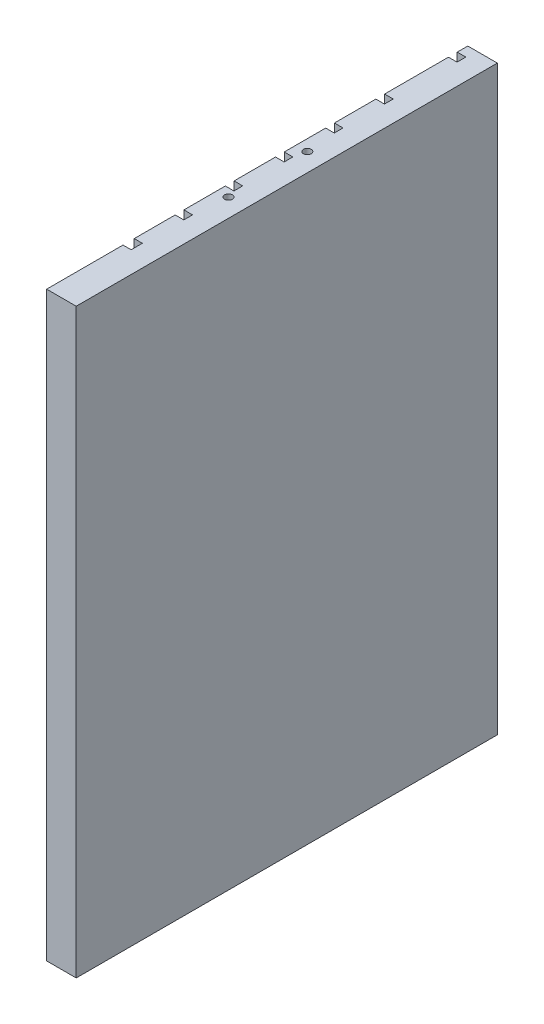
ISO-10303-21;
HEADER;
FILE_DESCRIPTION(('STEP AP214'),'2;1');
FILE_NAME('part.step','',(''),(''),'','','');
FILE_SCHEMA(('AUTOMOTIVE_DESIGN { 1 0 10303 214 1 1 1 1 }'));
ENDSEC;
DATA;
#1=APPLICATION_CONTEXT('core data for automotive mechanical design processes');
#2=APPLICATION_PROTOCOL_DEFINITION('international standard','automotive_design',2000,#1);
#3=PRODUCT_CONTEXT('',#1,'mechanical');
#4=PRODUCT('Part','Part','',(#3));
#5=PRODUCT_RELATED_PRODUCT_CATEGORY('part','',(#4));
#6=PRODUCT_DEFINITION_FORMATION('','',#4);
#7=PRODUCT_DEFINITION_CONTEXT('part definition',#1,'design');
#8=PRODUCT_DEFINITION('design','',#6,#7);
#9=PRODUCT_DEFINITION_SHAPE('','',#8);
#10=(LENGTH_UNIT() NAMED_UNIT(*) SI_UNIT(.MILLI.,.METRE.));
#11=(NAMED_UNIT(*) PLANE_ANGLE_UNIT() SI_UNIT($,.RADIAN.));
#12=(NAMED_UNIT(*) SI_UNIT($,.STERADIAN.) SOLID_ANGLE_UNIT());
#13=UNCERTAINTY_MEASURE_WITH_UNIT(LENGTH_MEASURE(1.E-05),#10,'distance_accuracy_value','');
#14=(GEOMETRIC_REPRESENTATION_CONTEXT(3) GLOBAL_UNCERTAINTY_ASSIGNED_CONTEXT((#13)) GLOBAL_UNIT_ASSIGNED_CONTEXT((#10,
#11,#12)) REPRESENTATION_CONTEXT('',''));
#15=CARTESIAN_POINT('',(0.,0.,0.));
#16=DIRECTION('',(0.,0.,1.));
#17=DIRECTION('',(1.,0.,0.));
#18=AXIS2_PLACEMENT_3D('',#15,#16,#17);
#19=CARTESIAN_POINT('',(101.4,58.5,8.56666666666665));
#20=DIRECTION('',(0.,1.,0.));
#21=DIRECTION('',(0.,0.,1.));
#22=AXIS2_PLACEMENT_3D('',#19,#20,#21);
#23=CONICAL_SURFACE('',#22,0.839500000000023,1.02974425867663);
#24=CARTESIAN_POINT('',(101.4,58.5,8.56666666666666));
#25=DIRECTION('',(0.,1.,0.));
#26=DIRECTION('',(0.,0.,1.));
#27=AXIS2_PLACEMENT_3D('',#24,#25,#26);
#28=CIRCLE('',#27,0.83950000000001);
#29=CARTESIAN_POINT('',(101.4,58.5,9.40616666666667));
#30=VERTEX_POINT('',#29);
#31=EDGE_CURVE('E487',#30,#30,#28,.T.);
#32=ORIENTED_EDGE('',*,*,#31,.T.);
#33=EDGE_LOOP('',(#32));
#34=FACE_BOUND('',#33,.T.);
#35=CARTESIAN_POINT('',(101.4,57.9955775103264,8.56666666666669));
#36=VERTEX_POINT('',#35);
#37=VERTEX_LOOP('',#36);
#38=FACE_BOUND('',#37,.T.);
#39=ADVANCED_FACE('F17',(#34,#38),#23,.F.);
#40=CARTESIAN_POINT('',(101.4,58.5,-8.36666666666667));
#41=DIRECTION('',(0.,1.,0.));
#42=DIRECTION('',(0.,0.,1.));
#43=AXIS2_PLACEMENT_3D('',#40,#41,#42);
#44=CONICAL_SURFACE('',#43,0.839500000000022,1.02974425867663);
#45=CARTESIAN_POINT('',(101.4,58.5,-8.36666666666666));
#46=DIRECTION('',(0.,1.,0.));
#47=DIRECTION('',(0.,0.,1.));
#48=AXIS2_PLACEMENT_3D('',#45,#46,#47);
#49=CIRCLE('',#48,0.83950000000001);
#50=CARTESIAN_POINT('',(101.4,58.5,-7.52716666666665));
#51=VERTEX_POINT('',#50);
#52=EDGE_CURVE('E484',#51,#51,#49,.T.);
#53=ORIENTED_EDGE('',*,*,#52,.T.);
#54=EDGE_LOOP('',(#53));
#55=FACE_BOUND('',#54,.T.);
#56=CARTESIAN_POINT('',(101.4,57.9955775103264,-8.36666666666664));
#57=VERTEX_POINT('',#56);
#58=VERTEX_LOOP('',#57);
#59=FACE_BOUND('',#58,.T.);
#60=ADVANCED_FACE('F232',(#55,#59),#44,.F.);
#61=CARTESIAN_POINT('',(101.4,62.5,8.56666666666666));
#62=DIRECTION('',(0.,-1.,0.));
#63=DIRECTION('',(0.,0.,-1.));
#64=AXIS2_PLACEMENT_3D('',#61,#62,#63);
#65=CYLINDRICAL_SURFACE('',#64,0.83950000000001);
#66=ORIENTED_EDGE('',*,*,#31,.F.);
#67=EDGE_LOOP('',(#66));
#68=FACE_BOUND('',#67,.T.);
#69=CARTESIAN_POINT('',(101.4,62.5,8.56666666666666));
#70=DIRECTION('',(0.,-1.,0.));
#71=DIRECTION('',(0.,0.,-1.));
#72=AXIS2_PLACEMENT_3D('',#69,#70,#71);
#73=CIRCLE('',#72,0.83950000000001);
#74=CARTESIAN_POINT('',(101.4,62.5,7.72716666666665));
#75=VERTEX_POINT('',#74);
#76=EDGE_CURVE('E21',#75,#75,#73,.T.);
#77=ORIENTED_EDGE('',*,*,#76,.F.);
#78=EDGE_LOOP('',(#77));
#79=FACE_BOUND('',#78,.T.);
#80=ADVANCED_FACE('F239',(#68,#79),#65,.F.);
#81=CARTESIAN_POINT('',(101.4,62.5,-8.36666666666666));
#82=DIRECTION('',(0.,-1.,0.));
#83=DIRECTION('',(0.,0.,-1.));
#84=AXIS2_PLACEMENT_3D('',#81,#82,#83);
#85=CYLINDRICAL_SURFACE('',#84,0.83950000000001);
#86=ORIENTED_EDGE('',*,*,#52,.F.);
#87=EDGE_LOOP('',(#86));
#88=FACE_BOUND('',#87,.T.);
#89=CARTESIAN_POINT('',(101.4,62.5,-8.36666666666666));
#90=DIRECTION('',(0.,-1.,0.));
#91=DIRECTION('',(0.,0.,-1.));
#92=AXIS2_PLACEMENT_3D('',#89,#90,#91);
#93=CIRCLE('',#92,0.83950000000001);
#94=CARTESIAN_POINT('',(101.4,62.5,-9.20616666666667));
#95=VERTEX_POINT('',#94);
#96=EDGE_CURVE('E329',#95,#95,#93,.T.);
#97=ORIENTED_EDGE('',*,*,#96,.F.);
#98=EDGE_LOOP('',(#97));
#99=FACE_BOUND('',#98,.T.);
#100=ADVANCED_FACE('F498',(#88,#99),#85,.F.);
#101=CARTESIAN_POINT('',(99.,62.5,-16.59));
#102=DIRECTION('',(-1.,0.,0.));
#103=DIRECTION('',(0.,0.,-1.));
#104=AXIS2_PLACEMENT_3D('',#101,#102,#103);
#105=PLANE('',#104);
#106=DIRECTION('',(0.,1.,0.));
#107=VECTOR('',#106,1.);
#108=CARTESIAN_POINT('',(99.,0.,-16.59));
#109=LINE('',#108,#107);
#110=CARTESIAN_POINT('',(99.,-62.5,-16.59));
#111=VERTEX_POINT('',#110);
#112=CARTESIAN_POINT('',(99.,62.5,-16.59));
#113=VERTEX_POINT('',#112);
#114=EDGE_CURVE('E482',#111,#113,#109,.T.);
#115=ORIENTED_EDGE('',*,*,#114,.T.);
#116=DIRECTION('',(0.,0.,1.));
#117=VECTOR('',#116,1.);
#118=CARTESIAN_POINT('',(99.,62.5,0.));
#119=LINE('',#118,#117);
#120=CARTESIAN_POINT('',(99.,62.5,-25.49));
#121=VERTEX_POINT('',#120);
#122=EDGE_CURVE('E414',#121,#113,#119,.T.);
#123=ORIENTED_EDGE('',*,*,#122,.F.);
#124=DIRECTION('',(0.,-1.,0.));
#125=VECTOR('',#124,1.);
#126=CARTESIAN_POINT('',(99.,0.,-25.49));
#127=LINE('',#126,#125);
#128=CARTESIAN_POINT('',(99.,-62.5,-25.49));
#129=VERTEX_POINT('',#128);
#130=EDGE_CURVE('E424',#121,#129,#127,.T.);
#131=ORIENTED_EDGE('',*,*,#130,.T.);
#132=DIRECTION('',(0.,0.,1.));
#133=VECTOR('',#132,1.);
#134=CARTESIAN_POINT('',(99.,-62.5,0.));
#135=LINE('',#134,#133);
#136=EDGE_CURVE('E323',#129,#111,#135,.T.);
#137=ORIENTED_EDGE('',*,*,#136,.T.);
#138=EDGE_LOOP('',(#115,#123,#131,#137));
#139=FACE_BOUND('',#138,.T.);
#140=ADVANCED_FACE('F504',(#139),#105,.T.);
#141=CARTESIAN_POINT('',(99.,62.5,-16.59));
#142=DIRECTION('',(0.,0.,-1.));
#143=DIRECTION('',(1.,0.,0.));
#144=AXIS2_PLACEMENT_3D('',#141,#142,#143);
#145=PLANE('',#144);
#146=ORIENTED_EDGE('',*,*,#114,.F.);
#147=DIRECTION('',(1.,0.,0.));
#148=VECTOR('',#147,1.);
#149=CARTESIAN_POINT('',(102.175000000001,-62.5,-16.59));
#150=LINE('',#149,#148);
#151=CARTESIAN_POINT('',(100.85,-62.5,-16.59));
#152=VERTEX_POINT('',#151);
#153=EDGE_CURVE('E321',#111,#152,#150,.T.);
#154=ORIENTED_EDGE('',*,*,#153,.T.);
#155=DIRECTION('',(0.,1.,0.));
#156=VECTOR('',#155,1.);
#157=CARTESIAN_POINT('',(100.85,0.,-16.59));
#158=LINE('',#157,#156);
#159=CARTESIAN_POINT('',(100.85,62.5,-16.59));
#160=VERTEX_POINT('',#159);
#161=EDGE_CURVE('E480',#152,#160,#158,.T.);
#162=ORIENTED_EDGE('',*,*,#161,.T.);
#163=DIRECTION('',(1.,0.,0.));
#164=VECTOR('',#163,1.);
#165=CARTESIAN_POINT('',(102.175,62.5,-16.59));
#166=LINE('',#165,#164);
#167=EDGE_CURVE('E411',#113,#160,#166,.T.);
#168=ORIENTED_EDGE('',*,*,#167,.F.);
#169=EDGE_LOOP('',(#146,#154,#162,#168));
#170=FACE_BOUND('',#169,.T.);
#171=ADVANCED_FACE('F511',(#170),#145,.F.);
#172=CARTESIAN_POINT('',(100.85,62.5,-16.59));
#173=DIRECTION('',(1.,0.,0.));
#174=DIRECTION('',(0.,0.,1.));
#175=AXIS2_PLACEMENT_3D('',#172,#173,#174);
#176=PLANE('',#175);
#177=ORIENTED_EDGE('',*,*,#161,.F.);
#178=DIRECTION('',(0.,0.,1.));
#179=VECTOR('',#178,1.);
#180=CARTESIAN_POINT('',(100.85,-62.5,0.));
#181=LINE('',#180,#179);
#182=CARTESIAN_POINT('',(100.85,-62.5,-14.71));
#183=VERTEX_POINT('',#182);
#184=EDGE_CURVE('E319',#152,#183,#181,.T.);
#185=ORIENTED_EDGE('',*,*,#184,.T.);
#186=DIRECTION('',(0.,1.,0.));
#187=VECTOR('',#186,1.);
#188=CARTESIAN_POINT('',(100.85,0.,-14.71));
#189=LINE('',#188,#187);
#190=CARTESIAN_POINT('',(100.85,62.5,-14.71));
#191=VERTEX_POINT('',#190);
#192=EDGE_CURVE('E478',#183,#191,#189,.T.);
#193=ORIENTED_EDGE('',*,*,#192,.T.);
#194=DIRECTION('',(0.,0.,1.));
#195=VECTOR('',#194,1.);
#196=CARTESIAN_POINT('',(100.85,62.5,0.));
#197=LINE('',#196,#195);
#198=EDGE_CURVE('E408',#160,#191,#197,.T.);
#199=ORIENTED_EDGE('',*,*,#198,.F.);
#200=EDGE_LOOP('',(#177,#185,#193,#199));
#201=FACE_BOUND('',#200,.T.);
#202=ADVANCED_FACE('F515',(#201),#176,.F.);
#203=CARTESIAN_POINT('',(100.85,62.5,-14.71));
#204=DIRECTION('',(0.,0.,1.));
#205=DIRECTION('',(-1.,0.,0.));
#206=AXIS2_PLACEMENT_3D('',#203,#204,#205);
#207=PLANE('',#206);
#208=ORIENTED_EDGE('',*,*,#192,.F.);
#209=DIRECTION('',(-1.,0.,0.));
#210=VECTOR('',#209,1.);
#211=CARTESIAN_POINT('',(102.175000000001,-62.5,-14.71));
#212=LINE('',#211,#210);
#213=CARTESIAN_POINT('',(99.,-62.5,-14.71));
#214=VERTEX_POINT('',#213);
#215=EDGE_CURVE('E317',#183,#214,#212,.T.);
#216=ORIENTED_EDGE('',*,*,#215,.T.);
#217=DIRECTION('',(0.,-1.,0.));
#218=VECTOR('',#217,1.);
#219=CARTESIAN_POINT('',(99.0000000000001,0.,-14.71));
#220=LINE('',#219,#218);
#221=CARTESIAN_POINT('',(99.,62.5,-14.71));
#222=VERTEX_POINT('',#221);
#223=EDGE_CURVE('E475',#222,#214,#220,.T.);
#224=ORIENTED_EDGE('',*,*,#223,.F.);
#225=DIRECTION('',(-1.,0.,0.));
#226=VECTOR('',#225,1.);
#227=CARTESIAN_POINT('',(102.175,62.5,-14.71));
#228=LINE('',#227,#226);
#229=EDGE_CURVE('E405',#191,#222,#228,.T.);
#230=ORIENTED_EDGE('',*,*,#229,.F.);
#231=EDGE_LOOP('',(#208,#216,#224,#230));
#232=FACE_BOUND('',#231,.T.);
#233=ADVANCED_FACE('F519',(#232),#207,.F.);
#234=CARTESIAN_POINT('',(99.,62.5,-5.81));
#235=DIRECTION('',(-1.,0.,0.));
#236=DIRECTION('',(0.,0.,-1.));
#237=AXIS2_PLACEMENT_3D('',#234,#235,#236);
#238=PLANE('',#237);
#239=ORIENTED_EDGE('',*,*,#223,.T.);
#240=DIRECTION('',(0.,0.,1.));
#241=VECTOR('',#240,1.);
#242=CARTESIAN_POINT('',(99.,-62.5,0.));
#243=LINE('',#242,#241);
#244=CARTESIAN_POINT('',(99.,-62.5,-5.81));
#245=VERTEX_POINT('',#244);
#246=EDGE_CURVE('E315',#214,#245,#243,.T.);
#247=ORIENTED_EDGE('',*,*,#246,.T.);
#248=DIRECTION('',(0.,1.,0.));
#249=VECTOR('',#248,1.);
#250=CARTESIAN_POINT('',(99.,0.,-5.81000000000001));
#251=LINE('',#250,#249);
#252=CARTESIAN_POINT('',(99.,62.5,-5.81000000000001));
#253=VERTEX_POINT('',#252);
#254=EDGE_CURVE('E473',#245,#253,#251,.T.);
#255=ORIENTED_EDGE('',*,*,#254,.T.);
#256=DIRECTION('',(0.,0.,1.));
#257=VECTOR('',#256,1.);
#258=CARTESIAN_POINT('',(99.,62.5,0.));
#259=LINE('',#258,#257);
#260=EDGE_CURVE('E402',#222,#253,#259,.T.);
#261=ORIENTED_EDGE('',*,*,#260,.F.);
#262=EDGE_LOOP('',(#239,#247,#255,#261));
#263=FACE_BOUND('',#262,.T.);
#264=ADVANCED_FACE('F523',(#263),#238,.T.);
#265=CARTESIAN_POINT('',(99.,62.5,-5.81000000000001));
#266=DIRECTION('',(0.,0.,-1.));
#267=DIRECTION('',(1.,0.,0.));
#268=AXIS2_PLACEMENT_3D('',#265,#266,#267);
#269=PLANE('',#268);
#270=ORIENTED_EDGE('',*,*,#254,.F.);
#271=DIRECTION('',(1.,0.,0.));
#272=VECTOR('',#271,1.);
#273=CARTESIAN_POINT('',(102.175000000001,-62.5,-5.81000000000001));
#274=LINE('',#273,#272);
#275=CARTESIAN_POINT('',(100.85,-62.5,-5.81000000000001));
#276=VERTEX_POINT('',#275);
#277=EDGE_CURVE('E313',#245,#276,#274,.T.);
#278=ORIENTED_EDGE('',*,*,#277,.T.);
#279=DIRECTION('',(0.,1.,0.));
#280=VECTOR('',#279,1.);
#281=CARTESIAN_POINT('',(100.85,0.,-5.81000000000001));
#282=LINE('',#281,#280);
#283=CARTESIAN_POINT('',(100.85,62.5,-5.81000000000001));
#284=VERTEX_POINT('',#283);
#285=EDGE_CURVE('E471',#276,#284,#282,.T.);
#286=ORIENTED_EDGE('',*,*,#285,.T.);
#287=DIRECTION('',(1.,0.,0.));
#288=VECTOR('',#287,1.);
#289=CARTESIAN_POINT('',(102.175,62.5,-5.81000000000001));
#290=LINE('',#289,#288);
#291=EDGE_CURVE('E399',#253,#284,#290,.T.);
#292=ORIENTED_EDGE('',*,*,#291,.F.);
#293=EDGE_LOOP('',(#270,#278,#286,#292));
#294=FACE_BOUND('',#293,.T.);
#295=ADVANCED_FACE('F527',(#294),#269,.F.);
#296=CARTESIAN_POINT('',(100.85,62.5,-5.81000000000001));
#297=DIRECTION('',(1.,0.,0.));
#298=DIRECTION('',(0.,0.,1.));
#299=AXIS2_PLACEMENT_3D('',#296,#297,#298);
#300=PLANE('',#299);
#301=ORIENTED_EDGE('',*,*,#285,.F.);
#302=DIRECTION('',(0.,0.,1.));
#303=VECTOR('',#302,1.);
#304=CARTESIAN_POINT('',(100.85,-62.5,0.));
#305=LINE('',#304,#303);
#306=CARTESIAN_POINT('',(100.85,-62.5,-3.93000000000001));
#307=VERTEX_POINT('',#306);
#308=EDGE_CURVE('E311',#276,#307,#305,.T.);
#309=ORIENTED_EDGE('',*,*,#308,.T.);
#310=DIRECTION('',(0.,1.,0.));
#311=VECTOR('',#310,1.);
#312=CARTESIAN_POINT('',(100.85,0.,-3.93000000000001));
#313=LINE('',#312,#311);
#314=CARTESIAN_POINT('',(100.85,62.5,-3.93000000000001));
#315=VERTEX_POINT('',#314);
#316=EDGE_CURVE('E469',#307,#315,#313,.T.);
#317=ORIENTED_EDGE('',*,*,#316,.T.);
#318=DIRECTION('',(0.,0.,1.));
#319=VECTOR('',#318,1.);
#320=CARTESIAN_POINT('',(100.85,62.5,0.));
#321=LINE('',#320,#319);
#322=EDGE_CURVE('E396',#284,#315,#321,.T.);
#323=ORIENTED_EDGE('',*,*,#322,.F.);
#324=EDGE_LOOP('',(#301,#309,#317,#323));
#325=FACE_BOUND('',#324,.T.);
#326=ADVANCED_FACE('F531',(#325),#300,.F.);
#327=CARTESIAN_POINT('',(100.85,62.5,-3.93000000000002));
#328=DIRECTION('',(0.,0.,1.));
#329=DIRECTION('',(-1.,0.,0.));
#330=AXIS2_PLACEMENT_3D('',#327,#328,#329);
#331=PLANE('',#330);
#332=ORIENTED_EDGE('',*,*,#316,.F.);
#333=DIRECTION('',(-1.,0.,0.));
#334=VECTOR('',#333,1.);
#335=CARTESIAN_POINT('',(102.175000000001,-62.5,-3.93000000000001));
#336=LINE('',#335,#334);
#337=CARTESIAN_POINT('',(99.,-62.5,-3.93000000000001));
#338=VERTEX_POINT('',#337);
#339=EDGE_CURVE('E309',#307,#338,#336,.T.);
#340=ORIENTED_EDGE('',*,*,#339,.T.);
#341=DIRECTION('',(0.,-1.,0.));
#342=VECTOR('',#341,1.);
#343=CARTESIAN_POINT('',(99.0000000000001,0.,-3.93000000000001));
#344=LINE('',#343,#342);
#345=CARTESIAN_POINT('',(99.,62.5,-3.93000000000002));
#346=VERTEX_POINT('',#345);
#347=EDGE_CURVE('E466',#346,#338,#344,.T.);
#348=ORIENTED_EDGE('',*,*,#347,.F.);
#349=DIRECTION('',(-1.,0.,0.));
#350=VECTOR('',#349,1.);
#351=CARTESIAN_POINT('',(102.175,62.5,-3.93000000000002));
#352=LINE('',#351,#350);
#353=EDGE_CURVE('E393',#315,#346,#352,.T.);
#354=ORIENTED_EDGE('',*,*,#353,.F.);
#355=EDGE_LOOP('',(#332,#340,#348,#354));
#356=FACE_BOUND('',#355,.T.);
#357=ADVANCED_FACE('F535',(#356),#331,.F.);
#358=CARTESIAN_POINT('',(99.,62.5,4.97));
#359=DIRECTION('',(-1.,0.,0.));
#360=DIRECTION('',(0.,0.,-1.));
#361=AXIS2_PLACEMENT_3D('',#358,#359,#360);
#362=PLANE('',#361);
#363=DIRECTION('',(0.,1.,0.));
#364=VECTOR('',#363,1.);
#365=CARTESIAN_POINT('',(99.,0.,4.97));
#366=LINE('',#365,#364);
#367=CARTESIAN_POINT('',(99.,-62.5,4.97));
#368=VERTEX_POINT('',#367);
#369=CARTESIAN_POINT('',(99.,62.5,4.97));
#370=VERTEX_POINT('',#369);
#371=EDGE_CURVE('E464',#368,#370,#366,.T.);
#372=ORIENTED_EDGE('',*,*,#371,.T.);
#373=DIRECTION('',(0.,0.,1.));
#374=VECTOR('',#373,1.);
#375=CARTESIAN_POINT('',(99.,62.5,0.));
#376=LINE('',#375,#374);
#377=EDGE_CURVE('E390',#346,#370,#376,.T.);
#378=ORIENTED_EDGE('',*,*,#377,.F.);
#379=ORIENTED_EDGE('',*,*,#347,.T.);
#380=DIRECTION('',(0.,0.,1.));
#381=VECTOR('',#380,1.);
#382=CARTESIAN_POINT('',(99.,-62.5,0.));
#383=LINE('',#382,#381);
#384=EDGE_CURVE('E307',#338,#368,#383,.T.);
#385=ORIENTED_EDGE('',*,*,#384,.T.);
#386=EDGE_LOOP('',(#372,#378,#379,#385));
#387=FACE_BOUND('',#386,.T.);
#388=ADVANCED_FACE('F539',(#387),#362,.T.);
#389=CARTESIAN_POINT('',(99.,62.5,4.96999999999999));
#390=DIRECTION('',(0.,0.,-1.));
#391=DIRECTION('',(1.,0.,0.));
#392=AXIS2_PLACEMENT_3D('',#389,#390,#391);
#393=PLANE('',#392);
#394=ORIENTED_EDGE('',*,*,#371,.F.);
#395=DIRECTION('',(1.,0.,0.));
#396=VECTOR('',#395,1.);
#397=CARTESIAN_POINT('',(102.175000000001,-62.5,4.97));
#398=LINE('',#397,#396);
#399=CARTESIAN_POINT('',(100.85,-62.5,4.97));
#400=VERTEX_POINT('',#399);
#401=EDGE_CURVE('E305',#368,#400,#398,.T.);
#402=ORIENTED_EDGE('',*,*,#401,.T.);
#403=DIRECTION('',(0.,1.,0.));
#404=VECTOR('',#403,1.);
#405=CARTESIAN_POINT('',(100.85,0.,4.96999999999999));
#406=LINE('',#405,#404);
#407=CARTESIAN_POINT('',(100.85,62.5,4.96999999999999));
#408=VERTEX_POINT('',#407);
#409=EDGE_CURVE('E462',#400,#408,#406,.T.);
#410=ORIENTED_EDGE('',*,*,#409,.T.);
#411=DIRECTION('',(1.,0.,0.));
#412=VECTOR('',#411,1.);
#413=CARTESIAN_POINT('',(102.175,62.5,4.97));
#414=LINE('',#413,#412);
#415=EDGE_CURVE('E387',#370,#408,#414,.T.);
#416=ORIENTED_EDGE('',*,*,#415,.F.);
#417=EDGE_LOOP('',(#394,#402,#410,#416));
#418=FACE_BOUND('',#417,.T.);
#419=ADVANCED_FACE('F543',(#418),#393,.F.);
#420=CARTESIAN_POINT('',(100.85,62.5,4.96999999999999));
#421=DIRECTION('',(1.,0.,0.));
#422=DIRECTION('',(0.,0.,1.));
#423=AXIS2_PLACEMENT_3D('',#420,#421,#422);
#424=PLANE('',#423);
#425=ORIENTED_EDGE('',*,*,#409,.F.);
#426=DIRECTION('',(0.,0.,1.));
#427=VECTOR('',#426,1.);
#428=CARTESIAN_POINT('',(100.85,-62.5,0.));
#429=LINE('',#428,#427);
#430=CARTESIAN_POINT('',(100.85,-62.5,6.85));
#431=VERTEX_POINT('',#430);
#432=EDGE_CURVE('E303',#400,#431,#429,.T.);
#433=ORIENTED_EDGE('',*,*,#432,.T.);
#434=DIRECTION('',(0.,1.,0.));
#435=VECTOR('',#434,1.);
#436=CARTESIAN_POINT('',(100.85,0.,6.84999999999999));
#437=LINE('',#436,#435);
#438=CARTESIAN_POINT('',(100.85,62.5,6.84999999999999));
#439=VERTEX_POINT('',#438);
#440=EDGE_CURVE('E460',#431,#439,#437,.T.);
#441=ORIENTED_EDGE('',*,*,#440,.T.);
#442=DIRECTION('',(0.,0.,1.));
#443=VECTOR('',#442,1.);
#444=CARTESIAN_POINT('',(100.85,62.5,0.));
#445=LINE('',#444,#443);
#446=EDGE_CURVE('E384',#408,#439,#445,.T.);
#447=ORIENTED_EDGE('',*,*,#446,.F.);
#448=EDGE_LOOP('',(#425,#433,#441,#447));
#449=FACE_BOUND('',#448,.T.);
#450=ADVANCED_FACE('F547',(#449),#424,.F.);
#451=CARTESIAN_POINT('',(100.85,62.5,6.84999999999999));
#452=DIRECTION('',(0.,0.,1.));
#453=DIRECTION('',(-1.,0.,0.));
#454=AXIS2_PLACEMENT_3D('',#451,#452,#453);
#455=PLANE('',#454);
#456=ORIENTED_EDGE('',*,*,#440,.F.);
#457=DIRECTION('',(-1.,0.,0.));
#458=VECTOR('',#457,1.);
#459=CARTESIAN_POINT('',(102.175000000001,-62.5,6.85));
#460=LINE('',#459,#458);
#461=CARTESIAN_POINT('',(99.,-62.5,6.84999999999999));
#462=VERTEX_POINT('',#461);
#463=EDGE_CURVE('E301',#431,#462,#460,.T.);
#464=ORIENTED_EDGE('',*,*,#463,.T.);
#465=DIRECTION('',(0.,-1.,0.));
#466=VECTOR('',#465,1.);
#467=CARTESIAN_POINT('',(99.0000000000001,0.,6.84999999999999));
#468=LINE('',#467,#466);
#469=CARTESIAN_POINT('',(99.,62.5,6.84999999999999));
#470=VERTEX_POINT('',#469);
#471=EDGE_CURVE('E457',#470,#462,#468,.T.);
#472=ORIENTED_EDGE('',*,*,#471,.F.);
#473=DIRECTION('',(-1.,0.,0.));
#474=VECTOR('',#473,1.);
#475=CARTESIAN_POINT('',(102.175,62.5,6.84999999999999));
#476=LINE('',#475,#474);
#477=EDGE_CURVE('E381',#439,#470,#476,.T.);
#478=ORIENTED_EDGE('',*,*,#477,.F.);
#479=EDGE_LOOP('',(#456,#464,#472,#478));
#480=FACE_BOUND('',#479,.T.);
#481=ADVANCED_FACE('F551',(#480),#455,.F.);
#482=CARTESIAN_POINT('',(99.,62.5,15.75));
#483=DIRECTION('',(-1.,0.,0.));
#484=DIRECTION('',(0.,0.,-1.));
#485=AXIS2_PLACEMENT_3D('',#482,#483,#484);
#486=PLANE('',#485);
#487=ORIENTED_EDGE('',*,*,#471,.T.);
#488=DIRECTION('',(0.,0.,1.));
#489=VECTOR('',#488,1.);
#490=CARTESIAN_POINT('',(99.,-62.5,0.));
#491=LINE('',#490,#489);
#492=CARTESIAN_POINT('',(99.,-62.5,15.75));
#493=VERTEX_POINT('',#492);
#494=EDGE_CURVE('E299',#462,#493,#491,.T.);
#495=ORIENTED_EDGE('',*,*,#494,.T.);
#496=DIRECTION('',(0.,1.,0.));
#497=VECTOR('',#496,1.);
#498=CARTESIAN_POINT('',(99.,0.,15.75));
#499=LINE('',#498,#497);
#500=CARTESIAN_POINT('',(99.,62.5,15.75));
#501=VERTEX_POINT('',#500);
#502=EDGE_CURVE('E455',#493,#501,#499,.T.);
#503=ORIENTED_EDGE('',*,*,#502,.T.);
#504=DIRECTION('',(0.,0.,1.));
#505=VECTOR('',#504,1.);
#506=CARTESIAN_POINT('',(99.,62.5,0.));
#507=LINE('',#506,#505);
#508=EDGE_CURVE('E378',#470,#501,#507,.T.);
#509=ORIENTED_EDGE('',*,*,#508,.F.);
#510=EDGE_LOOP('',(#487,#495,#503,#509));
#511=FACE_BOUND('',#510,.T.);
#512=ADVANCED_FACE('F555',(#511),#486,.T.);
#513=CARTESIAN_POINT('',(99.,62.5,15.75));
#514=DIRECTION('',(0.,0.,-1.));
#515=DIRECTION('',(1.,0.,0.));
#516=AXIS2_PLACEMENT_3D('',#513,#514,#515);
#517=PLANE('',#516);
#518=ORIENTED_EDGE('',*,*,#502,.F.);
#519=DIRECTION('',(1.,0.,0.));
#520=VECTOR('',#519,1.);
#521=CARTESIAN_POINT('',(102.175000000001,-62.5,15.75));
#522=LINE('',#521,#520);
#523=CARTESIAN_POINT('',(100.85,-62.5,15.75));
#524=VERTEX_POINT('',#523);
#525=EDGE_CURVE('E297',#493,#524,#522,.T.);
#526=ORIENTED_EDGE('',*,*,#525,.T.);
#527=DIRECTION('',(0.,1.,0.));
#528=VECTOR('',#527,1.);
#529=CARTESIAN_POINT('',(100.85,0.,15.75));
#530=LINE('',#529,#528);
#531=CARTESIAN_POINT('',(100.85,62.5,15.75));
#532=VERTEX_POINT('',#531);
#533=EDGE_CURVE('E453',#524,#532,#530,.T.);
#534=ORIENTED_EDGE('',*,*,#533,.T.);
#535=DIRECTION('',(1.,0.,0.));
#536=VECTOR('',#535,1.);
#537=CARTESIAN_POINT('',(102.175,62.5,15.75));
#538=LINE('',#537,#536);
#539=EDGE_CURVE('E375',#501,#532,#538,.T.);
#540=ORIENTED_EDGE('',*,*,#539,.F.);
#541=EDGE_LOOP('',(#518,#526,#534,#540));
#542=FACE_BOUND('',#541,.T.);
#543=ADVANCED_FACE('F559',(#542),#517,.F.);
#544=CARTESIAN_POINT('',(100.85,62.5,15.75));
#545=DIRECTION('',(1.,0.,0.));
#546=DIRECTION('',(0.,0.,1.));
#547=AXIS2_PLACEMENT_3D('',#544,#545,#546);
#548=PLANE('',#547);
#549=ORIENTED_EDGE('',*,*,#533,.F.);
#550=DIRECTION('',(0.,0.,1.));
#551=VECTOR('',#550,1.);
#552=CARTESIAN_POINT('',(100.85,-62.5,0.));
#553=LINE('',#552,#551);
#554=CARTESIAN_POINT('',(100.85,-62.5,17.63));
#555=VERTEX_POINT('',#554);
#556=EDGE_CURVE('E295',#524,#555,#553,.T.);
#557=ORIENTED_EDGE('',*,*,#556,.T.);
#558=DIRECTION('',(0.,1.,0.));
#559=VECTOR('',#558,1.);
#560=CARTESIAN_POINT('',(100.85,0.,17.63));
#561=LINE('',#560,#559);
#562=CARTESIAN_POINT('',(100.85,62.5,17.63));
#563=VERTEX_POINT('',#562);
#564=EDGE_CURVE('E451',#555,#563,#561,.T.);
#565=ORIENTED_EDGE('',*,*,#564,.T.);
#566=DIRECTION('',(0.,0.,1.));
#567=VECTOR('',#566,1.);
#568=CARTESIAN_POINT('',(100.85,62.5,0.));
#569=LINE('',#568,#567);
#570=EDGE_CURVE('E372',#532,#563,#569,.T.);
#571=ORIENTED_EDGE('',*,*,#570,.F.);
#572=EDGE_LOOP('',(#549,#557,#565,#571));
#573=FACE_BOUND('',#572,.T.);
#574=ADVANCED_FACE('F563',(#573),#548,.F.);
#575=CARTESIAN_POINT('',(100.85,62.5,17.63));
#576=DIRECTION('',(0.,0.,1.));
#577=DIRECTION('',(-1.,0.,0.));
#578=AXIS2_PLACEMENT_3D('',#575,#576,#577);
#579=PLANE('',#578);
#580=ORIENTED_EDGE('',*,*,#564,.F.);
#581=DIRECTION('',(-1.,0.,0.));
#582=VECTOR('',#581,1.);
#583=CARTESIAN_POINT('',(102.175000000001,-62.5,17.63));
#584=LINE('',#583,#582);
#585=CARTESIAN_POINT('',(99.,-62.5,17.63));
#586=VERTEX_POINT('',#585);
#587=EDGE_CURVE('E293',#555,#586,#584,.T.);
#588=ORIENTED_EDGE('',*,*,#587,.T.);
#589=DIRECTION('',(0.,-1.,0.));
#590=VECTOR('',#589,1.);
#591=CARTESIAN_POINT('',(99.0000000000001,0.,17.63));
#592=LINE('',#591,#590);
#593=CARTESIAN_POINT('',(99.,62.5,17.63));
#594=VERTEX_POINT('',#593);
#595=EDGE_CURVE('E448',#594,#586,#592,.T.);
#596=ORIENTED_EDGE('',*,*,#595,.F.);
#597=DIRECTION('',(-1.,0.,0.));
#598=VECTOR('',#597,1.);
#599=CARTESIAN_POINT('',(102.175,62.5,17.63));
#600=LINE('',#599,#598);
#601=EDGE_CURVE('E369',#563,#594,#600,.T.);
#602=ORIENTED_EDGE('',*,*,#601,.F.);
#603=EDGE_LOOP('',(#580,#588,#596,#602));
#604=FACE_BOUND('',#603,.T.);
#605=ADVANCED_FACE('F567',(#604),#579,.F.);
#606=CARTESIAN_POINT('',(99.,62.5,26.423));
#607=DIRECTION('',(-1.,0.,0.));
#608=DIRECTION('',(0.,0.,-1.));
#609=AXIS2_PLACEMENT_3D('',#606,#607,#608);
#610=PLANE('',#609);
#611=DIRECTION('',(0.,1.,0.));
#612=VECTOR('',#611,1.);
#613=CARTESIAN_POINT('',(99.,0.,26.423));
#614=LINE('',#613,#612);
#615=CARTESIAN_POINT('',(99.,-62.5,26.423));
#616=VERTEX_POINT('',#615);
#617=CARTESIAN_POINT('',(99.,62.5,26.423));
#618=VERTEX_POINT('',#617);
#619=EDGE_CURVE('E446',#616,#618,#614,.T.);
#620=ORIENTED_EDGE('',*,*,#619,.T.);
#621=DIRECTION('',(0.,0.,1.));
#622=VECTOR('',#621,1.);
#623=CARTESIAN_POINT('',(99.,62.5,0.));
#624=LINE('',#623,#622);
#625=EDGE_CURVE('E366',#594,#618,#624,.T.);
#626=ORIENTED_EDGE('',*,*,#625,.F.);
#627=ORIENTED_EDGE('',*,*,#595,.T.);
#628=DIRECTION('',(0.,0.,1.));
#629=VECTOR('',#628,1.);
#630=CARTESIAN_POINT('',(99.,-62.5,0.));
#631=LINE('',#630,#629);
#632=EDGE_CURVE('E291',#586,#616,#631,.T.);
#633=ORIENTED_EDGE('',*,*,#632,.T.);
#634=EDGE_LOOP('',(#620,#626,#627,#633));
#635=FACE_BOUND('',#634,.T.);
#636=ADVANCED_FACE('F571',(#635),#610,.T.);
#637=CARTESIAN_POINT('',(99.,62.5,26.423));
#638=DIRECTION('',(0.,0.,-1.));
#639=DIRECTION('',(1.,0.,0.));
#640=AXIS2_PLACEMENT_3D('',#637,#638,#639);
#641=PLANE('',#640);
#642=ORIENTED_EDGE('',*,*,#619,.F.);
#643=DIRECTION('',(1.,0.,0.));
#644=VECTOR('',#643,1.);
#645=CARTESIAN_POINT('',(102.175000000001,-62.5,26.423));
#646=LINE('',#645,#644);
#647=CARTESIAN_POINT('',(100.75,-62.5,26.423));
#648=VERTEX_POINT('',#647);
#649=EDGE_CURVE('E289',#616,#648,#646,.T.);
#650=ORIENTED_EDGE('',*,*,#649,.T.);
#651=DIRECTION('',(0.,1.,0.));
#652=VECTOR('',#651,1.);
#653=CARTESIAN_POINT('',(100.75,0.,26.423));
#654=LINE('',#653,#652);
#655=CARTESIAN_POINT('',(100.75,62.5,26.423));
#656=VERTEX_POINT('',#655);
#657=EDGE_CURVE('E444',#648,#656,#654,.T.);
#658=ORIENTED_EDGE('',*,*,#657,.T.);
#659=DIRECTION('',(1.,0.,0.));
#660=VECTOR('',#659,1.);
#661=CARTESIAN_POINT('',(102.175,62.5,26.423));
#662=LINE('',#661,#660);
#663=EDGE_CURVE('E363',#618,#656,#662,.T.);
#664=ORIENTED_EDGE('',*,*,#663,.F.);
#665=EDGE_LOOP('',(#642,#650,#658,#664));
#666=FACE_BOUND('',#665,.T.);
#667=ADVANCED_FACE('F575',(#666),#641,.F.);
#668=CARTESIAN_POINT('',(100.75,62.5,26.423));
#669=DIRECTION('',(1.,0.,0.));
#670=DIRECTION('',(0.,0.,1.));
#671=AXIS2_PLACEMENT_3D('',#668,#669,#670);
#672=PLANE('',#671);
#673=ORIENTED_EDGE('',*,*,#657,.F.);
#674=DIRECTION('',(0.,0.,1.));
#675=VECTOR('',#674,1.);
#676=CARTESIAN_POINT('',(100.75,-62.5,0.));
#677=LINE('',#676,#675);
#678=CARTESIAN_POINT('',(100.75,-62.5,28.837));
#679=VERTEX_POINT('',#678);
#680=EDGE_CURVE('E287',#648,#679,#677,.T.);
#681=ORIENTED_EDGE('',*,*,#680,.T.);
#682=DIRECTION('',(0.,1.,0.));
#683=VECTOR('',#682,1.);
#684=CARTESIAN_POINT('',(100.75,0.,28.837));
#685=LINE('',#684,#683);
#686=CARTESIAN_POINT('',(100.75,62.5,28.837));
#687=VERTEX_POINT('',#686);
#688=EDGE_CURVE('E442',#679,#687,#685,.T.);
#689=ORIENTED_EDGE('',*,*,#688,.T.);
#690=DIRECTION('',(0.,0.,1.));
#691=VECTOR('',#690,1.);
#692=CARTESIAN_POINT('',(100.75,62.5,0.));
#693=LINE('',#692,#691);
#694=EDGE_CURVE('E360',#656,#687,#693,.T.);
#695=ORIENTED_EDGE('',*,*,#694,.F.);
#696=EDGE_LOOP('',(#673,#681,#689,#695));
#697=FACE_BOUND('',#696,.T.);
#698=ADVANCED_FACE('F579',(#697),#672,.F.);
#699=CARTESIAN_POINT('',(100.75,62.5,28.837));
#700=DIRECTION('',(0.,0.,1.));
#701=DIRECTION('',(-1.,0.,0.));
#702=AXIS2_PLACEMENT_3D('',#699,#700,#701);
#703=PLANE('',#702);
#704=ORIENTED_EDGE('',*,*,#688,.F.);
#705=DIRECTION('',(-1.,0.,0.));
#706=VECTOR('',#705,1.);
#707=CARTESIAN_POINT('',(102.175000000001,-62.5,28.837));
#708=LINE('',#707,#706);
#709=CARTESIAN_POINT('',(99.,-62.5,28.837));
#710=VERTEX_POINT('',#709);
#711=EDGE_CURVE('E285',#679,#710,#708,.T.);
#712=ORIENTED_EDGE('',*,*,#711,.T.);
#713=DIRECTION('',(0.,-1.,0.));
#714=VECTOR('',#713,1.);
#715=CARTESIAN_POINT('',(99.0000000000001,0.,28.837));
#716=LINE('',#715,#714);
#717=CARTESIAN_POINT('',(99.,62.5,28.837));
#718=VERTEX_POINT('',#717);
#719=EDGE_CURVE('E439',#718,#710,#716,.T.);
#720=ORIENTED_EDGE('',*,*,#719,.F.);
#721=DIRECTION('',(-1.,0.,0.));
#722=VECTOR('',#721,1.);
#723=CARTESIAN_POINT('',(102.175,62.5,28.837));
#724=LINE('',#723,#722);
#725=EDGE_CURVE('E357',#687,#718,#724,.T.);
#726=ORIENTED_EDGE('',*,*,#725,.F.);
#727=EDGE_LOOP('',(#704,#712,#720,#726));
#728=FACE_BOUND('',#727,.T.);
#729=ADVANCED_FACE('F583',(#728),#703,.F.);
#730=CARTESIAN_POINT('',(99.,62.5,45.24));
#731=DIRECTION('',(-1.,0.,0.));
#732=DIRECTION('',(0.,0.,-1.));
#733=AXIS2_PLACEMENT_3D('',#730,#731,#732);
#734=PLANE('',#733);
#735=DIRECTION('',(0.,1.,0.));
#736=VECTOR('',#735,1.);
#737=CARTESIAN_POINT('',(99.,0.,45.24));
#738=LINE('',#737,#736);
#739=CARTESIAN_POINT('',(99.,-62.5,45.24));
#740=VERTEX_POINT('',#739);
#741=CARTESIAN_POINT('',(99.,62.5,45.24));
#742=VERTEX_POINT('',#741);
#743=EDGE_CURVE('E327',#740,#742,#738,.T.);
#744=ORIENTED_EDGE('',*,*,#743,.T.);
#745=DIRECTION('',(0.,0.,1.));
#746=VECTOR('',#745,1.);
#747=CARTESIAN_POINT('',(99.,62.5,0.));
#748=LINE('',#747,#746);
#749=EDGE_CURVE('E354',#718,#742,#748,.T.);
#750=ORIENTED_EDGE('',*,*,#749,.F.);
#751=ORIENTED_EDGE('',*,*,#719,.T.);
#752=DIRECTION('',(0.,0.,1.));
#753=VECTOR('',#752,1.);
#754=CARTESIAN_POINT('',(99.,-62.5,0.));
#755=LINE('',#754,#753);
#756=EDGE_CURVE('E283',#710,#740,#755,.T.);
#757=ORIENTED_EDGE('',*,*,#756,.T.);
#758=EDGE_LOOP('',(#744,#750,#751,#757));
#759=FACE_BOUND('',#758,.T.);
#760=ADVANCED_FACE('F587',(#759),#734,.T.);
#761=CARTESIAN_POINT('',(99.,62.5,-42.97));
#762=DIRECTION('',(-1.,0.,0.));
#763=DIRECTION('',(0.,0.,-1.));
#764=AXIS2_PLACEMENT_3D('',#761,#762,#763);
#765=PLANE('',#764);
#766=DIRECTION('',(0.,1.,0.));
#767=VECTOR('',#766,1.);
#768=CARTESIAN_POINT('',(99.,0.,-45.24));
#769=LINE('',#768,#767);
#770=CARTESIAN_POINT('',(99.,-62.5,-45.24));
#771=VERTEX_POINT('',#770);
#772=CARTESIAN_POINT('',(99.,62.5,-45.24));
#773=VERTEX_POINT('',#772);
#774=EDGE_CURVE('E420',#771,#773,#769,.T.);
#775=ORIENTED_EDGE('',*,*,#774,.F.);
#776=DIRECTION('',(0.,0.,1.));
#777=VECTOR('',#776,1.);
#778=CARTESIAN_POINT('',(99.,-62.5,0.));
#779=LINE('',#778,#777);
#780=CARTESIAN_POINT('',(99.,-62.5,-42.97));
#781=VERTEX_POINT('',#780);
#782=EDGE_CURVE('E277',#771,#781,#779,.T.);
#783=ORIENTED_EDGE('',*,*,#782,.T.);
#784=DIRECTION('',(0.,1.,0.));
#785=VECTOR('',#784,1.);
#786=CARTESIAN_POINT('',(99.,0.,-42.97));
#787=LINE('',#786,#785);
#788=CARTESIAN_POINT('',(99.,62.5,-42.97));
#789=VERTEX_POINT('',#788);
#790=EDGE_CURVE('E437',#781,#789,#787,.T.);
#791=ORIENTED_EDGE('',*,*,#790,.T.);
#792=DIRECTION('',(0.,0.,1.));
#793=VECTOR('',#792,1.);
#794=CARTESIAN_POINT('',(99.,62.5,0.));
#795=LINE('',#794,#793);
#796=EDGE_CURVE('E348',#773,#789,#795,.T.);
#797=ORIENTED_EDGE('',*,*,#796,.F.);
#798=EDGE_LOOP('',(#775,#783,#791,#797));
#799=FACE_BOUND('',#798,.T.);
#800=ADVANCED_FACE('F591',(#799),#765,.T.);
#801=CARTESIAN_POINT('',(99.,62.5,-42.97));
#802=DIRECTION('',(0.,0.,-1.));
#803=DIRECTION('',(1.,0.,0.));
#804=AXIS2_PLACEMENT_3D('',#801,#802,#803);
#805=PLANE('',#804);
#806=ORIENTED_EDGE('',*,*,#790,.F.);
#807=DIRECTION('',(1.,0.,0.));
#808=VECTOR('',#807,1.);
#809=CARTESIAN_POINT('',(102.175000000001,-62.5,-42.97));
#810=LINE('',#809,#808);
#811=CARTESIAN_POINT('',(100.85,-62.5,-42.97));
#812=VERTEX_POINT('',#811);
#813=EDGE_CURVE('E275',#781,#812,#810,.T.);
#814=ORIENTED_EDGE('',*,*,#813,.T.);
#815=DIRECTION('',(0.,1.,0.));
#816=VECTOR('',#815,1.);
#817=CARTESIAN_POINT('',(100.85,0.,-42.97));
#818=LINE('',#817,#816);
#819=CARTESIAN_POINT('',(100.85,62.5,-42.97));
#820=VERTEX_POINT('',#819);
#821=EDGE_CURVE('E435',#812,#820,#818,.T.);
#822=ORIENTED_EDGE('',*,*,#821,.T.);
#823=DIRECTION('',(1.,0.,0.));
#824=VECTOR('',#823,1.);
#825=CARTESIAN_POINT('',(102.175,62.5,-42.97));
#826=LINE('',#825,#824);
#827=EDGE_CURVE('E345',#789,#820,#826,.T.);
#828=ORIENTED_EDGE('',*,*,#827,.F.);
#829=EDGE_LOOP('',(#806,#814,#822,#828));
#830=FACE_BOUND('',#829,.T.);
#831=ADVANCED_FACE('F595',(#830),#805,.F.);
#832=CARTESIAN_POINT('',(100.85,62.5,-42.97));
#833=DIRECTION('',(1.,0.,0.));
#834=DIRECTION('',(0.,0.,1.));
#835=AXIS2_PLACEMENT_3D('',#832,#833,#834);
#836=PLANE('',#835);
#837=ORIENTED_EDGE('',*,*,#821,.F.);
#838=DIRECTION('',(0.,0.,1.));
#839=VECTOR('',#838,1.);
#840=CARTESIAN_POINT('',(100.85,-62.5,0.));
#841=LINE('',#840,#839);
#842=CARTESIAN_POINT('',(100.85,-62.5,-41.09));
#843=VERTEX_POINT('',#842);
#844=EDGE_CURVE('E273',#812,#843,#841,.T.);
#845=ORIENTED_EDGE('',*,*,#844,.T.);
#846=DIRECTION('',(0.,1.,0.));
#847=VECTOR('',#846,1.);
#848=CARTESIAN_POINT('',(100.85,0.,-41.09));
#849=LINE('',#848,#847);
#850=CARTESIAN_POINT('',(100.85,62.5,-41.09));
#851=VERTEX_POINT('',#850);
#852=EDGE_CURVE('E433',#843,#851,#849,.T.);
#853=ORIENTED_EDGE('',*,*,#852,.T.);
#854=DIRECTION('',(0.,0.,1.));
#855=VECTOR('',#854,1.);
#856=CARTESIAN_POINT('',(100.85,62.5,0.));
#857=LINE('',#856,#855);
#858=EDGE_CURVE('E342',#820,#851,#857,.T.);
#859=ORIENTED_EDGE('',*,*,#858,.F.);
#860=EDGE_LOOP('',(#837,#845,#853,#859));
#861=FACE_BOUND('',#860,.T.);
#862=ADVANCED_FACE('F599',(#861),#836,.F.);
#863=CARTESIAN_POINT('',(100.85,62.5,-41.09));
#864=DIRECTION('',(0.,0.,1.));
#865=DIRECTION('',(-1.,0.,0.));
#866=AXIS2_PLACEMENT_3D('',#863,#864,#865);
#867=PLANE('',#866);
#868=ORIENTED_EDGE('',*,*,#852,.F.);
#869=DIRECTION('',(-1.,0.,0.));
#870=VECTOR('',#869,1.);
#871=CARTESIAN_POINT('',(102.175000000001,-62.5,-41.09));
#872=LINE('',#871,#870);
#873=CARTESIAN_POINT('',(99.,-62.5,-41.09));
#874=VERTEX_POINT('',#873);
#875=EDGE_CURVE('E271',#843,#874,#872,.T.);
#876=ORIENTED_EDGE('',*,*,#875,.T.);
#877=DIRECTION('',(0.,-1.,0.));
#878=VECTOR('',#877,1.);
#879=CARTESIAN_POINT('',(99.0000000000001,0.,-41.09));
#880=LINE('',#879,#878);
#881=CARTESIAN_POINT('',(99.,62.5,-41.09));
#882=VERTEX_POINT('',#881);
#883=EDGE_CURVE('E430',#882,#874,#880,.T.);
#884=ORIENTED_EDGE('',*,*,#883,.F.);
#885=DIRECTION('',(-1.,0.,0.));
#886=VECTOR('',#885,1.);
#887=CARTESIAN_POINT('',(102.175,62.5,-41.09));
#888=LINE('',#887,#886);
#889=EDGE_CURVE('E339',#851,#882,#888,.T.);
#890=ORIENTED_EDGE('',*,*,#889,.F.);
#891=EDGE_LOOP('',(#868,#876,#884,#890));
#892=FACE_BOUND('',#891,.T.);
#893=ADVANCED_FACE('F603',(#892),#867,.F.);
#894=CARTESIAN_POINT('',(99.,62.5,-27.37));
#895=DIRECTION('',(-1.,0.,0.));
#896=DIRECTION('',(0.,0.,-1.));
#897=AXIS2_PLACEMENT_3D('',#894,#895,#896);
#898=PLANE('',#897);
#899=ORIENTED_EDGE('',*,*,#883,.T.);
#900=DIRECTION('',(0.,0.,1.));
#901=VECTOR('',#900,1.);
#902=CARTESIAN_POINT('',(99.,-62.5,0.));
#903=LINE('',#902,#901);
#904=CARTESIAN_POINT('',(99.,-62.5,-27.37));
#905=VERTEX_POINT('',#904);
#906=EDGE_CURVE('E269',#874,#905,#903,.T.);
#907=ORIENTED_EDGE('',*,*,#906,.T.);
#908=DIRECTION('',(0.,1.,0.));
#909=VECTOR('',#908,1.);
#910=CARTESIAN_POINT('',(99.,0.,-27.37));
#911=LINE('',#910,#909);
#912=CARTESIAN_POINT('',(99.,62.5,-27.37));
#913=VERTEX_POINT('',#912);
#914=EDGE_CURVE('E428',#905,#913,#911,.T.);
#915=ORIENTED_EDGE('',*,*,#914,.T.);
#916=DIRECTION('',(0.,0.,1.));
#917=VECTOR('',#916,1.);
#918=CARTESIAN_POINT('',(99.,62.5,0.));
#919=LINE('',#918,#917);
#920=EDGE_CURVE('E336',#882,#913,#919,.T.);
#921=ORIENTED_EDGE('',*,*,#920,.F.);
#922=EDGE_LOOP('',(#899,#907,#915,#921));
#923=FACE_BOUND('',#922,.T.);
#924=ADVANCED_FACE('F607',(#923),#898,.T.);
#925=CARTESIAN_POINT('',(99.,62.5,-27.37));
#926=DIRECTION('',(0.,0.,-1.));
#927=DIRECTION('',(1.,0.,0.));
#928=AXIS2_PLACEMENT_3D('',#925,#926,#927);
#929=PLANE('',#928);
#930=ORIENTED_EDGE('',*,*,#914,.F.);
#931=DIRECTION('',(1.,0.,0.));
#932=VECTOR('',#931,1.);
#933=CARTESIAN_POINT('',(102.175000000001,-62.5,-27.37));
#934=LINE('',#933,#932);
#935=CARTESIAN_POINT('',(100.85,-62.5,-27.37));
#936=VERTEX_POINT('',#935);
#937=EDGE_CURVE('E267',#905,#936,#934,.T.);
#938=ORIENTED_EDGE('',*,*,#937,.T.);
#939=DIRECTION('',(0.,1.,0.));
#940=VECTOR('',#939,1.);
#941=CARTESIAN_POINT('',(100.85,0.,-27.37));
#942=LINE('',#941,#940);
#943=CARTESIAN_POINT('',(100.85,62.5,-27.37));
#944=VERTEX_POINT('',#943);
#945=EDGE_CURVE('E426',#936,#944,#942,.T.);
#946=ORIENTED_EDGE('',*,*,#945,.T.);
#947=DIRECTION('',(1.,0.,0.));
#948=VECTOR('',#947,1.);
#949=CARTESIAN_POINT('',(102.175,62.5,-27.37));
#950=LINE('',#949,#948);
#951=EDGE_CURVE('E333',#913,#944,#950,.T.);
#952=ORIENTED_EDGE('',*,*,#951,.F.);
#953=EDGE_LOOP('',(#930,#938,#946,#952));
#954=FACE_BOUND('',#953,.T.);
#955=ADVANCED_FACE('F611',(#954),#929,.F.);
#956=CARTESIAN_POINT('',(100.85,62.5,-27.37));
#957=DIRECTION('',(1.,0.,0.));
#958=DIRECTION('',(0.,0.,1.));
#959=AXIS2_PLACEMENT_3D('',#956,#957,#958);
#960=PLANE('',#959);
#961=ORIENTED_EDGE('',*,*,#945,.F.);
#962=DIRECTION('',(0.,0.,1.));
#963=VECTOR('',#962,1.);
#964=CARTESIAN_POINT('',(100.85,-62.5,0.));
#965=LINE('',#964,#963);
#966=CARTESIAN_POINT('',(100.85,-62.5,-25.49));
#967=VERTEX_POINT('',#966);
#968=EDGE_CURVE('E265',#936,#967,#965,.T.);
#969=ORIENTED_EDGE('',*,*,#968,.T.);
#970=DIRECTION('',(0.,1.,0.));
#971=VECTOR('',#970,1.);
#972=CARTESIAN_POINT('',(100.85,0.,-25.49));
#973=LINE('',#972,#971);
#974=CARTESIAN_POINT('',(100.85,62.5,-25.49));
#975=VERTEX_POINT('',#974);
#976=EDGE_CURVE('E422',#967,#975,#973,.T.);
#977=ORIENTED_EDGE('',*,*,#976,.T.);
#978=DIRECTION('',(0.,0.,1.));
#979=VECTOR('',#978,1.);
#980=CARTESIAN_POINT('',(100.85,62.5,0.));
#981=LINE('',#980,#979);
#982=EDGE_CURVE('E330',#944,#975,#981,.T.);
#983=ORIENTED_EDGE('',*,*,#982,.F.);
#984=EDGE_LOOP('',(#961,#969,#977,#983));
#985=FACE_BOUND('',#984,.T.);
#986=ADVANCED_FACE('F615',(#985),#960,.F.);
#987=CARTESIAN_POINT('',(100.85,62.5,-25.49));
#988=DIRECTION('',(0.,0.,1.));
#989=DIRECTION('',(-1.,0.,0.));
#990=AXIS2_PLACEMENT_3D('',#987,#988,#989);
#991=PLANE('',#990);
#992=ORIENTED_EDGE('',*,*,#976,.F.);
#993=DIRECTION('',(-1.,0.,0.));
#994=VECTOR('',#993,1.);
#995=CARTESIAN_POINT('',(102.175000000001,-62.5,-25.49));
#996=LINE('',#995,#994);
#997=EDGE_CURVE('E262',#967,#129,#996,.T.);
#998=ORIENTED_EDGE('',*,*,#997,.T.);
#999=ORIENTED_EDGE('',*,*,#130,.F.);
#1000=DIRECTION('',(-1.,0.,0.));
#1001=VECTOR('',#1000,1.);
#1002=CARTESIAN_POINT('',(102.175,62.5,-25.49));
#1003=LINE('',#1002,#1001);
#1004=EDGE_CURVE('E417',#975,#121,#1003,.T.);
#1005=ORIENTED_EDGE('',*,*,#1004,.F.);
#1006=EDGE_LOOP('',(#992,#998,#999,#1005));
#1007=FACE_BOUND('',#1006,.T.);
#1008=ADVANCED_FACE('F619',(#1007),#991,.F.);
#1009=CARTESIAN_POINT('',(99.,62.5,-45.24));
#1010=DIRECTION('',(0.,0.,-1.));
#1011=DIRECTION('',(1.,0.,0.));
#1012=AXIS2_PLACEMENT_3D('',#1009,#1010,#1011);
#1013=PLANE('',#1012);
#1014=DIRECTION('',(-1.,0.,0.));
#1015=VECTOR('',#1014,1.);
#1016=CARTESIAN_POINT('',(102.175,62.5,-45.24));
#1017=LINE('',#1016,#1015);
#1018=CARTESIAN_POINT('',(105.350000000001,62.5,-45.24));
#1019=VERTEX_POINT('',#1018);
#1020=EDGE_CURVE('E351',#1019,#773,#1017,.T.);
#1021=ORIENTED_EDGE('',*,*,#1020,.F.);
#1022=DIRECTION('',(0.,1.,0.));
#1023=VECTOR('',#1022,1.);
#1024=CARTESIAN_POINT('',(105.350000000001,0.,-45.24));
#1025=LINE('',#1024,#1023);
#1026=CARTESIAN_POINT('',(105.350000000002,-62.5,-45.24));
#1027=VERTEX_POINT('',#1026);
#1028=EDGE_CURVE('E258',#1027,#1019,#1025,.T.);
#1029=ORIENTED_EDGE('',*,*,#1028,.F.);
#1030=DIRECTION('',(-1.,0.,0.));
#1031=VECTOR('',#1030,1.);
#1032=CARTESIAN_POINT('',(102.175000000001,-62.5,-45.24));
#1033=LINE('',#1032,#1031);
#1034=EDGE_CURVE('E279',#1027,#771,#1033,.T.);
#1035=ORIENTED_EDGE('',*,*,#1034,.T.);
#1036=ORIENTED_EDGE('',*,*,#774,.T.);
#1037=EDGE_LOOP('',(#1021,#1029,#1035,#1036));
#1038=FACE_BOUND('',#1037,.T.);
#1039=ADVANCED_FACE('F623',(#1038),#1013,.T.);
#1040=CARTESIAN_POINT('',(105.35,62.5,45.24));
#1041=DIRECTION('',(0.,1.,0.));
#1042=DIRECTION('',(0.,0.,-1.));
#1043=AXIS2_PLACEMENT_3D('',#1040,#1041,#1042);
#1044=PLANE('',#1043);
#1045=ORIENTED_EDGE('',*,*,#96,.T.);
#1046=EDGE_LOOP('',(#1045));
#1047=FACE_BOUND('',#1046,.T.);
#1048=ORIENTED_EDGE('',*,*,#76,.T.);
#1049=EDGE_LOOP('',(#1048));
#1050=FACE_BOUND('',#1049,.T.);
#1051=ORIENTED_EDGE('',*,*,#951,.T.);
#1052=ORIENTED_EDGE('',*,*,#982,.T.);
#1053=ORIENTED_EDGE('',*,*,#1004,.T.);
#1054=ORIENTED_EDGE('',*,*,#122,.T.);
#1055=ORIENTED_EDGE('',*,*,#167,.T.);
#1056=ORIENTED_EDGE('',*,*,#198,.T.);
#1057=ORIENTED_EDGE('',*,*,#229,.T.);
#1058=ORIENTED_EDGE('',*,*,#260,.T.);
#1059=ORIENTED_EDGE('',*,*,#291,.T.);
#1060=ORIENTED_EDGE('',*,*,#322,.T.);
#1061=ORIENTED_EDGE('',*,*,#353,.T.);
#1062=ORIENTED_EDGE('',*,*,#377,.T.);
#1063=ORIENTED_EDGE('',*,*,#415,.T.);
#1064=ORIENTED_EDGE('',*,*,#446,.T.);
#1065=ORIENTED_EDGE('',*,*,#477,.T.);
#1066=ORIENTED_EDGE('',*,*,#508,.T.);
#1067=ORIENTED_EDGE('',*,*,#539,.T.);
#1068=ORIENTED_EDGE('',*,*,#570,.T.);
#1069=ORIENTED_EDGE('',*,*,#601,.T.);
#1070=ORIENTED_EDGE('',*,*,#625,.T.);
#1071=ORIENTED_EDGE('',*,*,#663,.T.);
#1072=ORIENTED_EDGE('',*,*,#694,.T.);
#1073=ORIENTED_EDGE('',*,*,#725,.T.);
#1074=ORIENTED_EDGE('',*,*,#749,.T.);
#1075=DIRECTION('',(1.,0.,0.));
#1076=VECTOR('',#1075,1.);
#1077=CARTESIAN_POINT('',(102.175000000001,62.5,45.24));
#1078=LINE('',#1077,#1076);
#1079=CARTESIAN_POINT('',(105.35,62.5,45.24));
#1080=VERTEX_POINT('',#1079);
#1081=EDGE_CURVE('E325',#742,#1080,#1078,.T.);
#1082=ORIENTED_EDGE('',*,*,#1081,.T.);
#1083=DIRECTION('',(0.,0.,1.));
#1084=VECTOR('',#1083,1.);
#1085=CARTESIAN_POINT('',(105.35,62.5,0.));
#1086=LINE('',#1085,#1084);
#1087=EDGE_CURVE('E255',#1019,#1080,#1086,.T.);
#1088=ORIENTED_EDGE('',*,*,#1087,.F.);
#1089=ORIENTED_EDGE('',*,*,#1020,.T.);
#1090=ORIENTED_EDGE('',*,*,#796,.T.);
#1091=ORIENTED_EDGE('',*,*,#827,.T.);
#1092=ORIENTED_EDGE('',*,*,#858,.T.);
#1093=ORIENTED_EDGE('',*,*,#889,.T.);
#1094=ORIENTED_EDGE('',*,*,#920,.T.);
#1095=EDGE_LOOP('',(#1051,#1052,#1053,#1054,#1055,#1056,#1057,#1058,#1059,#1060,#1061,#1062,
#1063,#1064,#1065,#1066,#1067,#1068,#1069,#1070,#1071,#1072,#1073,#1074,#1082,#1088,#1089,#1090,
#1091,#1092,#1093,#1094));
#1096=FACE_BOUND('',#1095,.T.);
#1097=ADVANCED_FACE('F494',(#1047,#1050,#1096),#1044,.T.);
#1098=CARTESIAN_POINT('',(99.,62.5,45.24));
#1099=DIRECTION('',(0.,0.,-1.));
#1100=DIRECTION('',(1.,0.,0.));
#1101=AXIS2_PLACEMENT_3D('',#1098,#1099,#1100);
#1102=PLANE('',#1101);
#1103=DIRECTION('',(0.,-1.,0.));
#1104=VECTOR('',#1103,1.);
#1105=CARTESIAN_POINT('',(105.350000000001,0.,45.24));
#1106=LINE('',#1105,#1104);
#1107=CARTESIAN_POINT('',(105.350000000002,-62.5,45.24));
#1108=VERTEX_POINT('',#1107);
#1109=EDGE_CURVE('E27',#1080,#1108,#1106,.T.);
#1110=ORIENTED_EDGE('',*,*,#1109,.F.);
#1111=ORIENTED_EDGE('',*,*,#1081,.F.);
#1112=ORIENTED_EDGE('',*,*,#743,.F.);
#1113=DIRECTION('',(1.,0.,0.));
#1114=VECTOR('',#1113,1.);
#1115=CARTESIAN_POINT('',(102.175000000001,-62.5,45.24));
#1116=LINE('',#1115,#1114);
#1117=EDGE_CURVE('E36',#740,#1108,#1116,.T.);
#1118=ORIENTED_EDGE('',*,*,#1117,.T.);
#1119=EDGE_LOOP('',(#1110,#1111,#1112,#1118));
#1120=FACE_BOUND('',#1119,.T.);
#1121=ADVANCED_FACE('F249',(#1120),#1102,.F.);
#1122=CARTESIAN_POINT('',(105.350000000002,-62.5,45.24));
#1123=DIRECTION('',(0.,1.,0.));
#1124=DIRECTION('',(0.,0.,-1.));
#1125=AXIS2_PLACEMENT_3D('',#1122,#1123,#1124);
#1126=PLANE('',#1125);
#1127=ORIENTED_EDGE('',*,*,#968,.F.);
#1128=ORIENTED_EDGE('',*,*,#937,.F.);
#1129=ORIENTED_EDGE('',*,*,#906,.F.);
#1130=ORIENTED_EDGE('',*,*,#875,.F.);
#1131=ORIENTED_EDGE('',*,*,#844,.F.);
#1132=ORIENTED_EDGE('',*,*,#813,.F.);
#1133=ORIENTED_EDGE('',*,*,#782,.F.);
#1134=ORIENTED_EDGE('',*,*,#1034,.F.);
#1135=DIRECTION('',(0.,0.,-1.));
#1136=VECTOR('',#1135,1.);
#1137=CARTESIAN_POINT('',(105.350000000002,-62.5,0.));
#1138=LINE('',#1137,#1136);
#1139=EDGE_CURVE('E11',#1108,#1027,#1138,.T.);
#1140=ORIENTED_EDGE('',*,*,#1139,.F.);
#1141=ORIENTED_EDGE('',*,*,#1117,.F.);
#1142=ORIENTED_EDGE('',*,*,#756,.F.);
#1143=ORIENTED_EDGE('',*,*,#711,.F.);
#1144=ORIENTED_EDGE('',*,*,#680,.F.);
#1145=ORIENTED_EDGE('',*,*,#649,.F.);
#1146=ORIENTED_EDGE('',*,*,#632,.F.);
#1147=ORIENTED_EDGE('',*,*,#587,.F.);
#1148=ORIENTED_EDGE('',*,*,#556,.F.);
#1149=ORIENTED_EDGE('',*,*,#525,.F.);
#1150=ORIENTED_EDGE('',*,*,#494,.F.);
#1151=ORIENTED_EDGE('',*,*,#463,.F.);
#1152=ORIENTED_EDGE('',*,*,#432,.F.);
#1153=ORIENTED_EDGE('',*,*,#401,.F.);
#1154=ORIENTED_EDGE('',*,*,#384,.F.);
#1155=ORIENTED_EDGE('',*,*,#339,.F.);
#1156=ORIENTED_EDGE('',*,*,#308,.F.);
#1157=ORIENTED_EDGE('',*,*,#277,.F.);
#1158=ORIENTED_EDGE('',*,*,#246,.F.);
#1159=ORIENTED_EDGE('',*,*,#215,.F.);
#1160=ORIENTED_EDGE('',*,*,#184,.F.);
#1161=ORIENTED_EDGE('',*,*,#153,.F.);
#1162=ORIENTED_EDGE('',*,*,#136,.F.);
#1163=ORIENTED_EDGE('',*,*,#997,.F.);
#1164=EDGE_LOOP('',(#1127,#1128,#1129,#1130,#1131,#1132,#1133,#1134,#1140,#1141,#1142,#1143,
#1144,#1145,#1146,#1147,#1148,#1149,#1150,#1151,#1152,#1153,#1154,#1155,#1156,#1157,#1158,#1159,
#1160,#1161,#1162,#1163));
#1165=FACE_BOUND('',#1164,.T.);
#1166=ADVANCED_FACE('F244',(#1165),#1126,.F.);
#1167=CARTESIAN_POINT('',(105.35,62.5,-45.24));
#1168=DIRECTION('',(1.,0.,0.));
#1169=DIRECTION('',(0.,0.,1.));
#1170=AXIS2_PLACEMENT_3D('',#1167,#1168,#1169);
#1171=PLANE('',#1170);
#1172=ORIENTED_EDGE('',*,*,#1109,.T.);
#1173=ORIENTED_EDGE('',*,*,#1139,.T.);
#1174=ORIENTED_EDGE('',*,*,#1028,.T.);
#1175=ORIENTED_EDGE('',*,*,#1087,.T.);
#1176=EDGE_LOOP('',(#1172,#1173,#1174,#1175));
#1177=FACE_BOUND('',#1176,.T.);
#1178=ADVANCED_FACE('F19',(#1177),#1171,.T.);
#1179=CLOSED_SHELL('',(#39,#60,#80,#100,#140,#171,#202,#233,#264,#295,#326,#357,#388,#419,#450,
#481,#512,#543,#574,#605,#636,#667,#698,#729,#760,#800,#831,#862,#893,#924,#955,#986,#1008,
#1039,#1097,#1121,#1166,#1178));
#1180=MANIFOLD_SOLID_BREP('B1',#1179);
#1181=ADVANCED_BREP_SHAPE_REPRESENTATION('',(#18,#1180),#14);
#1182=SHAPE_DEFINITION_REPRESENTATION(#9,#1181);
ENDSEC;
END-ISO-10303-21;
